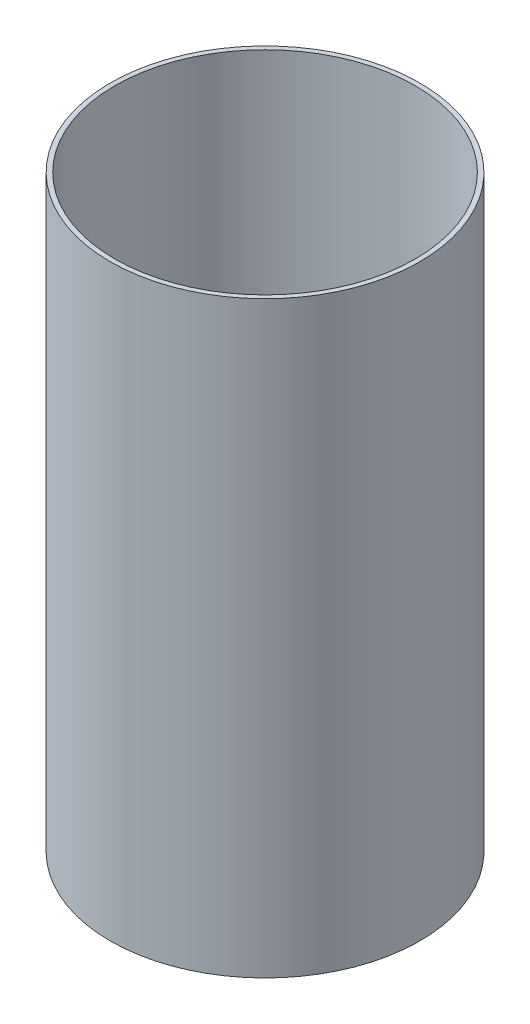
ISO-10303-21;
HEADER;
FILE_DESCRIPTION(('STEP AP214'),'2;1');
FILE_NAME('part.step','',(''),(''),'','','');
FILE_SCHEMA(('AUTOMOTIVE_DESIGN { 1 0 10303 214 1 1 1 1 }'));
ENDSEC;
DATA;
#1=APPLICATION_CONTEXT('core data for automotive mechanical design processes');
#2=APPLICATION_PROTOCOL_DEFINITION('international standard','automotive_design',2000,#1);
#3=PRODUCT_CONTEXT('',#1,'mechanical');
#4=PRODUCT('Part','Part','',(#3));
#5=PRODUCT_RELATED_PRODUCT_CATEGORY('part','',(#4));
#6=PRODUCT_DEFINITION_FORMATION('','',#4);
#7=PRODUCT_DEFINITION_CONTEXT('part definition',#1,'design');
#8=PRODUCT_DEFINITION('design','',#6,#7);
#9=PRODUCT_DEFINITION_SHAPE('','',#8);
#10=(LENGTH_UNIT() NAMED_UNIT(*) SI_UNIT(.MILLI.,.METRE.));
#11=(NAMED_UNIT(*) PLANE_ANGLE_UNIT() SI_UNIT($,.RADIAN.));
#12=(NAMED_UNIT(*) SI_UNIT($,.STERADIAN.) SOLID_ANGLE_UNIT());
#13=UNCERTAINTY_MEASURE_WITH_UNIT(LENGTH_MEASURE(1.E-05),#10,'distance_accuracy_value','');
#14=(GEOMETRIC_REPRESENTATION_CONTEXT(3) GLOBAL_UNCERTAINTY_ASSIGNED_CONTEXT((#13)) GLOBAL_UNIT_ASSIGNED_CONTEXT((#10,
#11,#12)) REPRESENTATION_CONTEXT('',''));
#15=CARTESIAN_POINT('',(0.,0.,0.));
#16=DIRECTION('',(0.,0.,1.));
#17=DIRECTION('',(1.,0.,0.));
#18=AXIS2_PLACEMENT_3D('',#15,#16,#17);
#19=CARTESIAN_POINT('',(0.,120.65,0.));
#20=DIRECTION('',(0.,1.,0.));
#21=DIRECTION('',(0.,0.,1.));
#22=AXIS2_PLACEMENT_3D('',#19,#20,#21);
#23=PLANE('',#22);
#24=CARTESIAN_POINT('',(0.,120.65,0.));
#25=DIRECTION('',(0.,1.,0.));
#26=DIRECTION('',(0.,0.,1.));
#27=AXIS2_PLACEMENT_3D('',#24,#25,#26);
#28=CIRCLE('',#27,63.5);
#29=CARTESIAN_POINT('',(0.,120.65,63.5));
#30=VERTEX_POINT('',#29);
#31=EDGE_CURVE('E10',#30,#30,#28,.T.);
#32=ORIENTED_EDGE('',*,*,#31,.T.);
#33=EDGE_LOOP('',(#32));
#34=FACE_BOUND('',#33,.T.);
#35=CARTESIAN_POINT('',(0.,120.65,0.));
#36=DIRECTION('',(0.,1.,0.));
#37=DIRECTION('',(0.,0.,1.));
#38=AXIS2_PLACEMENT_3D('',#35,#36,#37);
#39=CIRCLE('',#38,61.595);
#40=CARTESIAN_POINT('',(0.,120.65,61.595));
#41=VERTEX_POINT('',#40);
#42=EDGE_CURVE('E46',#41,#41,#39,.T.);
#43=ORIENTED_EDGE('',*,*,#42,.F.);
#44=EDGE_LOOP('',(#43));
#45=FACE_BOUND('',#44,.T.);
#46=ADVANCED_FACE('F35',(#34,#45),#23,.T.);
#47=CARTESIAN_POINT('',(0.,-120.65,0.));
#48=DIRECTION('',(0.,1.,0.));
#49=DIRECTION('',(0.,0.,1.));
#50=AXIS2_PLACEMENT_3D('',#47,#48,#49);
#51=PLANE('',#50);
#52=CARTESIAN_POINT('',(0.,-120.65,0.));
#53=DIRECTION('',(0.,1.,0.));
#54=DIRECTION('',(0.,0.,1.));
#55=AXIS2_PLACEMENT_3D('',#52,#53,#54);
#56=CIRCLE('',#55,63.5);
#57=CARTESIAN_POINT('',(0.,-120.65,63.5));
#58=VERTEX_POINT('',#57);
#59=EDGE_CURVE('E39',#58,#58,#56,.T.);
#60=ORIENTED_EDGE('',*,*,#59,.F.);
#61=EDGE_LOOP('',(#60));
#62=FACE_BOUND('',#61,.T.);
#63=CARTESIAN_POINT('',(0.,-120.65,0.));
#64=DIRECTION('',(0.,1.,0.));
#65=DIRECTION('',(0.,0.,1.));
#66=AXIS2_PLACEMENT_3D('',#63,#64,#65);
#67=CIRCLE('',#66,61.595);
#68=CARTESIAN_POINT('',(0.,-120.65,61.595));
#69=VERTEX_POINT('',#68);
#70=EDGE_CURVE('E48',#69,#69,#67,.T.);
#71=ORIENTED_EDGE('',*,*,#70,.T.);
#72=EDGE_LOOP('',(#71));
#73=FACE_BOUND('',#72,.T.);
#74=ADVANCED_FACE('F58',(#62,#73),#51,.F.);
#75=CARTESIAN_POINT('',(0.,120.65,0.));
#76=DIRECTION('',(0.,-1.,0.));
#77=DIRECTION('',(0.,0.,-1.));
#78=AXIS2_PLACEMENT_3D('',#75,#76,#77);
#79=CYLINDRICAL_SURFACE('',#78,63.5);
#80=ORIENTED_EDGE('',*,*,#31,.F.);
#81=EDGE_LOOP('',(#80));
#82=FACE_BOUND('',#81,.T.);
#83=ORIENTED_EDGE('',*,*,#59,.T.);
#84=EDGE_LOOP('',(#83));
#85=FACE_BOUND('',#84,.T.);
#86=ADVANCED_FACE('F37',(#82,#85),#79,.T.);
#87=CARTESIAN_POINT('',(0.,120.65,0.));
#88=DIRECTION('',(0.,-1.,0.));
#89=DIRECTION('',(0.,0.,-1.));
#90=AXIS2_PLACEMENT_3D('',#87,#88,#89);
#91=CYLINDRICAL_SURFACE('',#90,61.595);
#92=ORIENTED_EDGE('',*,*,#42,.T.);
#93=EDGE_LOOP('',(#92));
#94=FACE_BOUND('',#93,.T.);
#95=ORIENTED_EDGE('',*,*,#70,.F.);
#96=EDGE_LOOP('',(#95));
#97=FACE_BOUND('',#96,.T.);
#98=ADVANCED_FACE('F54',(#94,#97),#91,.F.);
#99=CLOSED_SHELL('',(#46,#74,#86,#98));
#100=MANIFOLD_SOLID_BREP('B2',#99);
#101=ADVANCED_BREP_SHAPE_REPRESENTATION('',(#18,#100),#14);
#102=SHAPE_DEFINITION_REPRESENTATION(#9,#101);
ENDSEC;
END-ISO-10303-21;
